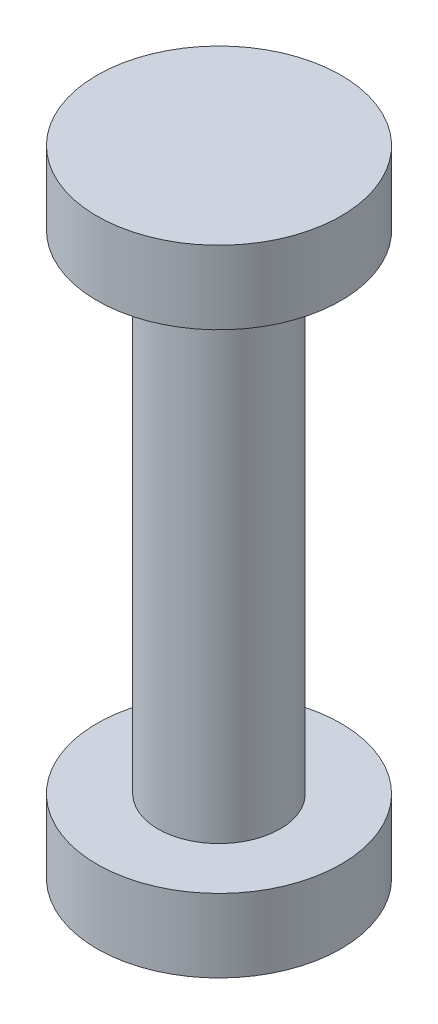
ISO-10303-21;
HEADER;
FILE_DESCRIPTION(('STEP AP214'),'2;1');
FILE_NAME('part.step','',(''),(''),'','','');
FILE_SCHEMA(('AUTOMOTIVE_DESIGN { 1 0 10303 214 1 1 1 1 }'));
ENDSEC;
DATA;
#1=APPLICATION_CONTEXT('core data for automotive mechanical design processes');
#2=APPLICATION_PROTOCOL_DEFINITION('international standard','automotive_design',2000,#1);
#3=PRODUCT_CONTEXT('',#1,'mechanical');
#4=PRODUCT('Part','Part','',(#3));
#5=PRODUCT_RELATED_PRODUCT_CATEGORY('part','',(#4));
#6=PRODUCT_DEFINITION_FORMATION('','',#4);
#7=PRODUCT_DEFINITION_CONTEXT('part definition',#1,'design');
#8=PRODUCT_DEFINITION('design','',#6,#7);
#9=PRODUCT_DEFINITION_SHAPE('','',#8);
#10=(LENGTH_UNIT() NAMED_UNIT(*) SI_UNIT(.MILLI.,.METRE.));
#11=(NAMED_UNIT(*) PLANE_ANGLE_UNIT() SI_UNIT($,.RADIAN.));
#12=(NAMED_UNIT(*) SI_UNIT($,.STERADIAN.) SOLID_ANGLE_UNIT());
#13=UNCERTAINTY_MEASURE_WITH_UNIT(LENGTH_MEASURE(1.E-05),#10,'distance_accuracy_value','');
#14=(GEOMETRIC_REPRESENTATION_CONTEXT(3) GLOBAL_UNCERTAINTY_ASSIGNED_CONTEXT((#13)) GLOBAL_UNIT_ASSIGNED_CONTEXT((#10,
#11,#12)) REPRESENTATION_CONTEXT('',''));
#15=CARTESIAN_POINT('',(0.,0.,0.));
#16=DIRECTION('',(0.,0.,1.));
#17=DIRECTION('',(1.,0.,0.));
#18=AXIS2_PLACEMENT_3D('',#15,#16,#17);
#19=CARTESIAN_POINT('',(0.,-20.,0.));
#20=DIRECTION('',(0.,1.,0.));
#21=DIRECTION('',(-1.,0.,0.));
#22=AXIS2_PLACEMENT_3D('',#19,#20,#21);
#23=CYLINDRICAL_SURFACE('',#22,2.5);
#24=CARTESIAN_POINT('',(0.,-20.,0.));
#25=DIRECTION('',(0.,-1.,0.));
#26=DIRECTION('',(1.,0.,0.));
#27=AXIS2_PLACEMENT_3D('',#24,#25,#26);
#28=CIRCLE('',#27,2.5);
#29=CARTESIAN_POINT('',(2.5,-20.,0.));
#30=VERTEX_POINT('',#29);
#31=EDGE_CURVE('E10',#30,#30,#28,.T.);
#32=ORIENTED_EDGE('',*,*,#31,.F.);
#33=EDGE_LOOP('',(#32));
#34=FACE_BOUND('',#33,.T.);
#35=CARTESIAN_POINT('',(0.,0.,0.));
#36=DIRECTION('',(0.,-1.,0.));
#37=DIRECTION('',(1.,0.,0.));
#38=AXIS2_PLACEMENT_3D('',#35,#36,#37);
#39=CIRCLE('',#38,2.5);
#40=CARTESIAN_POINT('',(2.5,0.,0.));
#41=VERTEX_POINT('',#40);
#42=EDGE_CURVE('E22',#41,#41,#39,.T.);
#43=ORIENTED_EDGE('',*,*,#42,.T.);
#44=EDGE_LOOP('',(#43));
#45=FACE_BOUND('',#44,.T.);
#46=ADVANCED_FACE('F15',(#34,#45),#23,.T.);
#47=CARTESIAN_POINT('',(0.,-23.,0.));
#48=DIRECTION('',(0.,1.,0.));
#49=DIRECTION('',(-1.,0.,0.));
#50=AXIS2_PLACEMENT_3D('',#47,#48,#49);
#51=CYLINDRICAL_SURFACE('',#50,5.0004696903643);
#52=CARTESIAN_POINT('',(0.,-23.,0.));
#53=DIRECTION('',(0.,-1.,0.));
#54=DIRECTION('',(1.,0.,0.));
#55=AXIS2_PLACEMENT_3D('',#52,#53,#54);
#56=CIRCLE('',#55,5.0004696903643);
#57=CARTESIAN_POINT('',(5.0004696903643,-23.,0.));
#58=VERTEX_POINT('',#57);
#59=EDGE_CURVE('E29',#58,#58,#56,.T.);
#60=ORIENTED_EDGE('',*,*,#59,.F.);
#61=EDGE_LOOP('',(#60));
#62=FACE_BOUND('',#61,.T.);
#63=CARTESIAN_POINT('',(0.,-20.,0.));
#64=DIRECTION('',(0.,-1.,0.));
#65=DIRECTION('',(1.,0.,0.));
#66=AXIS2_PLACEMENT_3D('',#63,#64,#65);
#67=CIRCLE('',#66,5.0004696903643);
#68=CARTESIAN_POINT('',(5.0004696903643,-20.,0.));
#69=VERTEX_POINT('',#68);
#70=EDGE_CURVE('E35',#69,#69,#67,.T.);
#71=ORIENTED_EDGE('',*,*,#70,.T.);
#72=EDGE_LOOP('',(#71));
#73=FACE_BOUND('',#72,.T.);
#74=ADVANCED_FACE('F66',(#62,#73),#51,.T.);
#75=CARTESIAN_POINT('',(0.,-23.,0.));
#76=DIRECTION('',(0.,-1.,0.));
#77=DIRECTION('',(1.,0.,0.));
#78=AXIS2_PLACEMENT_3D('',#75,#76,#77);
#79=PLANE('',#78);
#80=ORIENTED_EDGE('',*,*,#59,.T.);
#81=EDGE_LOOP('',(#80));
#82=FACE_BOUND('',#81,.T.);
#83=ADVANCED_FACE('F71',(#82),#79,.T.);
#84=CARTESIAN_POINT('',(0.,-20.,0.));
#85=DIRECTION('',(0.,-1.,0.));
#86=DIRECTION('',(1.,0.,0.));
#87=AXIS2_PLACEMENT_3D('',#84,#85,#86);
#88=PLANE('',#87);
#89=ORIENTED_EDGE('',*,*,#31,.T.);
#90=EDGE_LOOP('',(#89));
#91=FACE_BOUND('',#90,.T.);
#92=ORIENTED_EDGE('',*,*,#70,.F.);
#93=EDGE_LOOP('',(#92));
#94=FACE_BOUND('',#93,.T.);
#95=ADVANCED_FACE('F76',(#91,#94),#88,.F.);
#96=CARTESIAN_POINT('',(0.,3.,0.));
#97=DIRECTION('',(0.,-1.,0.));
#98=DIRECTION('',(1.,0.,0.));
#99=AXIS2_PLACEMENT_3D('',#96,#97,#98);
#100=CYLINDRICAL_SURFACE('',#99,5.0004696903643);
#101=CARTESIAN_POINT('',(0.,3.,0.));
#102=DIRECTION('',(0.,1.,0.));
#103=DIRECTION('',(-1.,0.,0.));
#104=AXIS2_PLACEMENT_3D('',#101,#102,#103);
#105=CIRCLE('',#104,5.0004696903643);
#106=CARTESIAN_POINT('',(-5.0004696903643,3.,0.));
#107=VERTEX_POINT('',#106);
#108=EDGE_CURVE('E41',#107,#107,#105,.T.);
#109=ORIENTED_EDGE('',*,*,#108,.F.);
#110=EDGE_LOOP('',(#109));
#111=FACE_BOUND('',#110,.T.);
#112=CARTESIAN_POINT('',(0.,0.,0.));
#113=DIRECTION('',(0.,1.,0.));
#114=DIRECTION('',(-1.,0.,0.));
#115=AXIS2_PLACEMENT_3D('',#112,#113,#114);
#116=CIRCLE('',#115,5.0004696903643);
#117=CARTESIAN_POINT('',(-5.0004696903643,0.,0.));
#118=VERTEX_POINT('',#117);
#119=EDGE_CURVE('E45',#118,#118,#116,.T.);
#120=ORIENTED_EDGE('',*,*,#119,.T.);
#121=EDGE_LOOP('',(#120));
#122=FACE_BOUND('',#121,.T.);
#123=ADVANCED_FACE('F52',(#111,#122),#100,.T.);
#124=CARTESIAN_POINT('',(0.,3.,0.));
#125=DIRECTION('',(0.,1.,0.));
#126=DIRECTION('',(-1.,0.,0.));
#127=AXIS2_PLACEMENT_3D('',#124,#125,#126);
#128=PLANE('',#127);
#129=ORIENTED_EDGE('',*,*,#108,.T.);
#130=EDGE_LOOP('',(#129));
#131=FACE_BOUND('',#130,.T.);
#132=ADVANCED_FACE('F56',(#131),#128,.T.);
#133=CARTESIAN_POINT('',(0.,0.,0.));
#134=DIRECTION('',(0.,1.,0.));
#135=DIRECTION('',(-1.,0.,0.));
#136=AXIS2_PLACEMENT_3D('',#133,#134,#135);
#137=PLANE('',#136);
#138=ORIENTED_EDGE('',*,*,#42,.F.);
#139=EDGE_LOOP('',(#138));
#140=FACE_BOUND('',#139,.T.);
#141=ORIENTED_EDGE('',*,*,#119,.F.);
#142=EDGE_LOOP('',(#141));
#143=FACE_BOUND('',#142,.T.);
#144=ADVANCED_FACE('F54',(#140,#143),#137,.F.);
#145=CLOSED_SHELL('',(#46,#74,#83,#95,#123,#132,#144));
#146=MANIFOLD_SOLID_BREP('B1',#145);
#147=ADVANCED_BREP_SHAPE_REPRESENTATION('',(#18,#146),#14);
#148=SHAPE_DEFINITION_REPRESENTATION(#9,#147);
ENDSEC;
END-ISO-10303-21;
